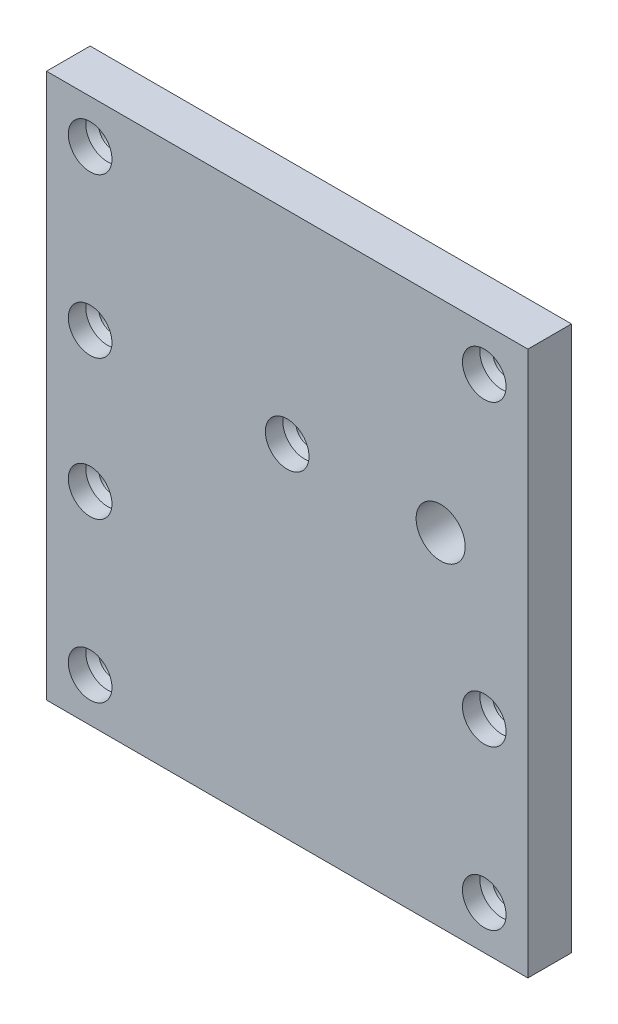
ISO-10303-21;
HEADER;
FILE_DESCRIPTION(('STEP AP214'),'2;1');
FILE_NAME('part.step','',(''),(''),'','','');
FILE_SCHEMA(('AUTOMOTIVE_DESIGN { 1 0 10303 214 1 1 1 1 }'));
ENDSEC;
DATA;
#1=APPLICATION_CONTEXT('core data for automotive mechanical design processes');
#2=APPLICATION_PROTOCOL_DEFINITION('international standard','automotive_design',2000,#1);
#3=PRODUCT_CONTEXT('',#1,'mechanical');
#4=PRODUCT('Part','Part','',(#3));
#5=PRODUCT_RELATED_PRODUCT_CATEGORY('part','',(#4));
#6=PRODUCT_DEFINITION_FORMATION('','',#4);
#7=PRODUCT_DEFINITION_CONTEXT('part definition',#1,'design');
#8=PRODUCT_DEFINITION('design','',#6,#7);
#9=PRODUCT_DEFINITION_SHAPE('','',#8);
#10=(LENGTH_UNIT() NAMED_UNIT(*) SI_UNIT(.MILLI.,.METRE.));
#11=(NAMED_UNIT(*) PLANE_ANGLE_UNIT() SI_UNIT($,.RADIAN.));
#12=(NAMED_UNIT(*) SI_UNIT($,.STERADIAN.) SOLID_ANGLE_UNIT());
#13=UNCERTAINTY_MEASURE_WITH_UNIT(LENGTH_MEASURE(1.E-05),#10,'distance_accuracy_value','');
#14=(GEOMETRIC_REPRESENTATION_CONTEXT(3) GLOBAL_UNCERTAINTY_ASSIGNED_CONTEXT((#13)) GLOBAL_UNIT_ASSIGNED_CONTEXT((#10,
#11,#12)) REPRESENTATION_CONTEXT('',''));
#15=CARTESIAN_POINT('',(0.,0.,0.));
#16=DIRECTION('',(0.,0.,1.));
#17=DIRECTION('',(1.,0.,0.));
#18=AXIS2_PLACEMENT_3D('',#15,#16,#17);
#19=CARTESIAN_POINT('',(20.3421458224966,15.5298639823762,3.175));
#20=DIRECTION('',(-1.,0.,0.));
#21=DIRECTION('',(0.,0.,1.));
#22=AXIS2_PLACEMENT_3D('',#19,#20,#21);
#23=PLANE('',#22);
#24=DIRECTION('',(0.,1.,0.));
#25=VECTOR('',#24,1.);
#26=CARTESIAN_POINT('',(20.3421458224966,15.5298639823762,0.));
#27=LINE('',#26,#25);
#28=CARTESIAN_POINT('',(20.3421458224966,15.5298639823762,0.));
#29=VERTEX_POINT('',#28);
#30=CARTESIAN_POINT('',(20.3421458224966,55.1792639823763,0.));
#31=VERTEX_POINT('',#30);
#32=EDGE_CURVE('E98',#29,#31,#27,.T.);
#33=ORIENTED_EDGE('',*,*,#32,.T.);
#34=DIRECTION('',(0.,0.,-1.));
#35=VECTOR('',#34,1.);
#36=CARTESIAN_POINT('',(20.3421458224966,55.1792639823763,3.175));
#37=LINE('',#36,#35);
#38=CARTESIAN_POINT('',(20.3421458224966,55.1792639823763,3.175));
#39=VERTEX_POINT('',#38);
#40=EDGE_CURVE('E11',#39,#31,#37,.T.);
#41=ORIENTED_EDGE('',*,*,#40,.F.);
#42=DIRECTION('',(0.,1.,0.));
#43=VECTOR('',#42,1.);
#44=CARTESIAN_POINT('',(20.3421458224966,15.5298639823762,3.175));
#45=LINE('',#44,#43);
#46=CARTESIAN_POINT('',(20.3421458224966,15.5298639823762,3.175));
#47=VERTEX_POINT('',#46);
#48=EDGE_CURVE('E85',#47,#39,#45,.T.);
#49=ORIENTED_EDGE('',*,*,#48,.F.);
#50=DIRECTION('',(0.,0.,-1.));
#51=VECTOR('',#50,1.);
#52=CARTESIAN_POINT('',(20.3421458224966,15.5298639823762,3.175));
#53=LINE('',#52,#51);
#54=EDGE_CURVE('E94',#47,#29,#53,.T.);
#55=ORIENTED_EDGE('',*,*,#54,.T.);
#56=EDGE_LOOP('',(#33,#41,#49,#55));
#57=FACE_BOUND('',#56,.T.);
#58=ADVANCED_FACE('F32',(#57),#23,.F.);
#59=CARTESIAN_POINT('',(20.3421458224966,55.1792639823763,3.175));
#60=DIRECTION('',(0.,-1.,0.));
#61=DIRECTION('',(1.,0.,0.));
#62=AXIS2_PLACEMENT_3D('',#59,#60,#61);
#63=PLANE('',#62);
#64=DIRECTION('',(-1.,0.,0.));
#65=VECTOR('',#64,1.);
#66=CARTESIAN_POINT('',(20.3421458224966,55.1792639823763,0.));
#67=LINE('',#66,#65);
#68=CARTESIAN_POINT('',(-14.7,55.1792639823762,0.));
#69=VERTEX_POINT('',#68);
#70=EDGE_CURVE('E89',#31,#69,#67,.T.);
#71=ORIENTED_EDGE('',*,*,#70,.T.);
#72=DIRECTION('',(0.,0.,-1.));
#73=VECTOR('',#72,1.);
#74=CARTESIAN_POINT('',(-14.7,55.1792639823762,3.175));
#75=LINE('',#74,#73);
#76=CARTESIAN_POINT('',(-14.7,55.1792639823762,3.175));
#77=VERTEX_POINT('',#76);
#78=EDGE_CURVE('E41',#77,#69,#75,.T.);
#79=ORIENTED_EDGE('',*,*,#78,.F.);
#80=DIRECTION('',(-1.,0.,0.));
#81=VECTOR('',#80,1.);
#82=CARTESIAN_POINT('',(20.3421458224966,55.1792639823763,3.175));
#83=LINE('',#82,#81);
#84=EDGE_CURVE('E80',#39,#77,#83,.T.);
#85=ORIENTED_EDGE('',*,*,#84,.F.);
#86=ORIENTED_EDGE('',*,*,#40,.T.);
#87=EDGE_LOOP('',(#71,#79,#85,#86));
#88=FACE_BOUND('',#87,.T.);
#89=ADVANCED_FACE('F88',(#88),#63,.F.);
#90=CARTESIAN_POINT('',(-14.7,15.5298639823762,3.175));
#91=DIRECTION('',(1.,0.,0.));
#92=DIRECTION('',(0.,0.,-1.));
#93=AXIS2_PLACEMENT_3D('',#90,#91,#92);
#94=PLANE('',#93);
#95=DIRECTION('',(0.,-1.,0.));
#96=VECTOR('',#95,1.);
#97=CARTESIAN_POINT('',(-14.7,15.5298639823762,0.));
#98=LINE('',#97,#96);
#99=CARTESIAN_POINT('',(-14.7,15.5298639823762,0.));
#100=VERTEX_POINT('',#99);
#101=EDGE_CURVE('E67',#69,#100,#98,.T.);
#102=ORIENTED_EDGE('',*,*,#101,.T.);
#103=DIRECTION('',(0.,0.,-1.));
#104=VECTOR('',#103,1.);
#105=CARTESIAN_POINT('',(-14.7,15.5298639823762,3.175));
#106=LINE('',#105,#104);
#107=CARTESIAN_POINT('',(-14.7,15.5298639823762,3.175));
#108=VERTEX_POINT('',#107);
#109=EDGE_CURVE('E90',#108,#100,#106,.T.);
#110=ORIENTED_EDGE('',*,*,#109,.F.);
#111=DIRECTION('',(0.,-1.,0.));
#112=VECTOR('',#111,1.);
#113=CARTESIAN_POINT('',(-14.7,15.5298639823762,3.175));
#114=LINE('',#113,#112);
#115=EDGE_CURVE('E83',#77,#108,#114,.T.);
#116=ORIENTED_EDGE('',*,*,#115,.F.);
#117=ORIENTED_EDGE('',*,*,#78,.T.);
#118=EDGE_LOOP('',(#102,#110,#116,#117));
#119=FACE_BOUND('',#118,.T.);
#120=ADVANCED_FACE('F92',(#119),#94,.F.);
#121=CARTESIAN_POINT('',(20.3421458224966,15.5298639823762,3.175));
#122=DIRECTION('',(0.,1.,0.));
#123=DIRECTION('',(-1.,0.,0.));
#124=AXIS2_PLACEMENT_3D('',#121,#122,#123);
#125=PLANE('',#124);
#126=DIRECTION('',(1.,0.,0.));
#127=VECTOR('',#126,1.);
#128=CARTESIAN_POINT('',(20.3421458224966,15.5298639823762,0.));
#129=LINE('',#128,#127);
#130=EDGE_CURVE('E73',#100,#29,#129,.T.);
#131=ORIENTED_EDGE('',*,*,#130,.T.);
#132=ORIENTED_EDGE('',*,*,#54,.F.);
#133=DIRECTION('',(1.,0.,0.));
#134=VECTOR('',#133,1.);
#135=CARTESIAN_POINT('',(20.3421458224966,15.5298639823762,3.175));
#136=LINE('',#135,#134);
#137=EDGE_CURVE('E50',#108,#47,#136,.T.);
#138=ORIENTED_EDGE('',*,*,#137,.F.);
#139=ORIENTED_EDGE('',*,*,#109,.T.);
#140=EDGE_LOOP('',(#131,#132,#138,#139));
#141=FACE_BOUND('',#140,.T.);
#142=ADVANCED_FACE('F215',(#141),#125,.F.);
#143=CARTESIAN_POINT('',(0.,0.,3.175));
#144=DIRECTION('',(0.,0.,1.));
#145=DIRECTION('',(1.,0.,0.));
#146=AXIS2_PLACEMENT_3D('',#143,#144,#145);
#147=PLANE('',#146);
#148=CARTESIAN_POINT('',(17.1671458224966,18.7048639823763,3.175));
#149=DIRECTION('',(0.,0.,1.));
#150=DIRECTION('',(1.,0.,0.));
#151=AXIS2_PLACEMENT_3D('',#148,#149,#150);
#152=CIRCLE('',#151,1.58749999999999);
#153=CARTESIAN_POINT('',(18.7546458224966,18.7048639823763,3.175));
#154=VERTEX_POINT('',#153);
#155=EDGE_CURVE('E505',#154,#154,#152,.T.);
#156=ORIENTED_EDGE('',*,*,#155,.F.);
#157=EDGE_LOOP('',(#156));
#158=FACE_BOUND('',#157,.T.);
#159=CARTESIAN_POINT('',(-11.5249999999999,18.7048639823763,3.175));
#160=DIRECTION('',(0.,0.,1.));
#161=DIRECTION('',(1.,0.,0.));
#162=AXIS2_PLACEMENT_3D('',#159,#160,#161);
#163=CIRCLE('',#162,1.58749999999999);
#164=CARTESIAN_POINT('',(-9.93749999999996,18.7048639823763,3.175));
#165=VERTEX_POINT('',#164);
#166=EDGE_CURVE('E145',#165,#165,#163,.T.);
#167=ORIENTED_EDGE('',*,*,#166,.F.);
#168=EDGE_LOOP('',(#167));
#169=FACE_BOUND('',#168,.T.);
#170=CARTESIAN_POINT('',(-11.525,30.2745639823762,3.175));
#171=DIRECTION('',(0.,0.,1.));
#172=DIRECTION('',(1.,0.,0.));
#173=AXIS2_PLACEMENT_3D('',#170,#171,#172);
#174=CIRCLE('',#173,1.58749999999999);
#175=CARTESIAN_POINT('',(-9.93749999999997,30.2745639823762,3.175));
#176=VERTEX_POINT('',#175);
#177=EDGE_CURVE('E138',#176,#176,#174,.T.);
#178=ORIENTED_EDGE('',*,*,#177,.F.);
#179=EDGE_LOOP('',(#178));
#180=FACE_BOUND('',#179,.T.);
#181=CARTESIAN_POINT('',(17.1671458224966,30.2745639823762,3.175));
#182=DIRECTION('',(0.,0.,1.));
#183=DIRECTION('',(1.,0.,0.));
#184=AXIS2_PLACEMENT_3D('',#181,#182,#183);
#185=CIRCLE('',#184,1.58749999999999);
#186=CARTESIAN_POINT('',(18.7546458224966,30.2745639823762,3.175));
#187=VERTEX_POINT('',#186);
#188=EDGE_CURVE('E134',#187,#187,#185,.T.);
#189=ORIENTED_EDGE('',*,*,#188,.F.);
#190=EDGE_LOOP('',(#189));
#191=FACE_BOUND('',#190,.T.);
#192=CARTESIAN_POINT('',(2.82107291124833,40.4345639823763,3.175));
#193=DIRECTION('',(0.,0.,1.));
#194=DIRECTION('',(1.,0.,0.));
#195=AXIS2_PLACEMENT_3D('',#192,#193,#194);
#196=CIRCLE('',#195,1.58749999999999);
#197=CARTESIAN_POINT('',(4.40857291124832,40.4345639823763,3.175));
#198=VERTEX_POINT('',#197);
#199=EDGE_CURVE('E130',#198,#198,#196,.T.);
#200=ORIENTED_EDGE('',*,*,#199,.F.);
#201=EDGE_LOOP('',(#200));
#202=FACE_BOUND('',#201,.T.);
#203=CARTESIAN_POINT('',(-11.525,40.4345639823763,3.175));
#204=DIRECTION('',(0.,0.,1.));
#205=DIRECTION('',(1.,0.,0.));
#206=AXIS2_PLACEMENT_3D('',#203,#204,#205);
#207=CIRCLE('',#206,1.58749999999999);
#208=CARTESIAN_POINT('',(-9.93749999999997,40.4345639823763,3.175));
#209=VERTEX_POINT('',#208);
#210=EDGE_CURVE('E125',#209,#209,#207,.T.);
#211=ORIENTED_EDGE('',*,*,#210,.F.);
#212=EDGE_LOOP('',(#211));
#213=FACE_BOUND('',#212,.T.);
#214=CARTESIAN_POINT('',(17.1671458224966,52.0042639823762,3.175));
#215=DIRECTION('',(0.,0.,1.));
#216=DIRECTION('',(1.,0.,0.));
#217=AXIS2_PLACEMENT_3D('',#214,#215,#216);
#218=CIRCLE('',#217,1.58749999999999);
#219=CARTESIAN_POINT('',(18.7546458224966,52.0042639823762,3.175));
#220=VERTEX_POINT('',#219);
#221=EDGE_CURVE('E120',#220,#220,#218,.T.);
#222=ORIENTED_EDGE('',*,*,#221,.F.);
#223=EDGE_LOOP('',(#222));
#224=FACE_BOUND('',#223,.T.);
#225=CARTESIAN_POINT('',(-11.525,52.0042639823762,3.175));
#226=DIRECTION('',(0.,0.,1.));
#227=DIRECTION('',(1.,0.,0.));
#228=AXIS2_PLACEMENT_3D('',#225,#226,#227);
#229=CIRCLE('',#228,1.58749999999999);
#230=CARTESIAN_POINT('',(-9.93749999999997,52.0042639823762,3.175));
#231=VERTEX_POINT('',#230);
#232=EDGE_CURVE('E115',#231,#231,#229,.T.);
#233=ORIENTED_EDGE('',*,*,#232,.F.);
#234=EDGE_LOOP('',(#233));
#235=FACE_BOUND('',#234,.T.);
#236=CARTESIAN_POINT('',(13.9921458224967,40.4345639823762,3.175));
#237=DIRECTION('',(0.,0.,1.));
#238=DIRECTION('',(1.,0.,0.));
#239=AXIS2_PLACEMENT_3D('',#236,#237,#238);
#240=CIRCLE('',#239,1.786001);
#241=CARTESIAN_POINT('',(15.7781468224967,40.4345639823762,3.175));
#242=VERTEX_POINT('',#241);
#243=EDGE_CURVE('E198',#242,#242,#240,.T.);
#244=ORIENTED_EDGE('',*,*,#243,.F.);
#245=EDGE_LOOP('',(#244));
#246=FACE_BOUND('',#245,.T.);
#247=ORIENTED_EDGE('',*,*,#48,.T.);
#248=ORIENTED_EDGE('',*,*,#84,.T.);
#249=ORIENTED_EDGE('',*,*,#115,.T.);
#250=ORIENTED_EDGE('',*,*,#137,.T.);
#251=EDGE_LOOP('',(#247,#248,#249,#250));
#252=FACE_BOUND('',#251,.T.);
#253=ADVANCED_FACE('F81',(#158,#169,#180,#191,#202,#213,#224,#235,#246,#252),#147,.T.);
#254=CARTESIAN_POINT('',(0.,0.,0.));
#255=DIRECTION('',(0.,0.,1.));
#256=DIRECTION('',(1.,0.,0.));
#257=AXIS2_PLACEMENT_3D('',#254,#255,#256);
#258=PLANE('',#257);
#259=CARTESIAN_POINT('',(-11.525,40.4345639823763,0.));
#260=DIRECTION('',(0.,0.,1.));
#261=DIRECTION('',(1.,0.,0.));
#262=AXIS2_PLACEMENT_3D('',#259,#260,#261);
#263=CIRCLE('',#262,0.992251);
#264=CARTESIAN_POINT('',(-10.532749,40.4345639823763,0.));
#265=VERTEX_POINT('',#264);
#266=EDGE_CURVE('E110',#265,#265,#263,.T.);
#267=ORIENTED_EDGE('',*,*,#266,.T.);
#268=EDGE_LOOP('',(#267));
#269=FACE_BOUND('',#268,.T.);
#270=CARTESIAN_POINT('',(-11.525,52.0042639823762,0.));
#271=DIRECTION('',(0.,0.,1.));
#272=DIRECTION('',(1.,0.,0.));
#273=AXIS2_PLACEMENT_3D('',#270,#271,#272);
#274=CIRCLE('',#273,0.992251);
#275=CARTESIAN_POINT('',(-10.532749,52.0042639823762,0.));
#276=VERTEX_POINT('',#275);
#277=EDGE_CURVE('E177',#276,#276,#274,.T.);
#278=ORIENTED_EDGE('',*,*,#277,.T.);
#279=EDGE_LOOP('',(#278));
#280=FACE_BOUND('',#279,.T.);
#281=CARTESIAN_POINT('',(17.1671458224966,52.0042639823762,0.));
#282=DIRECTION('',(0.,0.,1.));
#283=DIRECTION('',(1.,0.,0.));
#284=AXIS2_PLACEMENT_3D('',#281,#282,#283);
#285=CIRCLE('',#284,0.992251);
#286=CARTESIAN_POINT('',(18.1593968224966,52.0042639823762,0.));
#287=VERTEX_POINT('',#286);
#288=EDGE_CURVE('E180',#287,#287,#285,.T.);
#289=ORIENTED_EDGE('',*,*,#288,.T.);
#290=EDGE_LOOP('',(#289));
#291=FACE_BOUND('',#290,.T.);
#292=CARTESIAN_POINT('',(2.82107291124833,40.4345639823763,0.));
#293=DIRECTION('',(0.,0.,1.));
#294=DIRECTION('',(1.,0.,0.));
#295=AXIS2_PLACEMENT_3D('',#292,#293,#294);
#296=CIRCLE('',#295,0.992250999999999);
#297=CARTESIAN_POINT('',(3.81332391124833,40.4345639823763,0.));
#298=VERTEX_POINT('',#297);
#299=EDGE_CURVE('E183',#298,#298,#296,.T.);
#300=ORIENTED_EDGE('',*,*,#299,.T.);
#301=EDGE_LOOP('',(#300));
#302=FACE_BOUND('',#301,.T.);
#303=CARTESIAN_POINT('',(-11.525,30.2745639823762,0.));
#304=DIRECTION('',(0.,0.,1.));
#305=DIRECTION('',(1.,0.,0.));
#306=AXIS2_PLACEMENT_3D('',#303,#304,#305);
#307=CIRCLE('',#306,0.992251);
#308=CARTESIAN_POINT('',(-10.532749,30.2745639823762,0.));
#309=VERTEX_POINT('',#308);
#310=EDGE_CURVE('E186',#309,#309,#307,.T.);
#311=ORIENTED_EDGE('',*,*,#310,.T.);
#312=EDGE_LOOP('',(#311));
#313=FACE_BOUND('',#312,.T.);
#314=CARTESIAN_POINT('',(-11.5249999999999,18.7048639823763,0.));
#315=DIRECTION('',(0.,0.,1.));
#316=DIRECTION('',(1.,0.,0.));
#317=AXIS2_PLACEMENT_3D('',#314,#315,#316);
#318=CIRCLE('',#317,0.992251);
#319=CARTESIAN_POINT('',(-10.5327489999999,18.7048639823763,0.));
#320=VERTEX_POINT('',#319);
#321=EDGE_CURVE('E189',#320,#320,#318,.T.);
#322=ORIENTED_EDGE('',*,*,#321,.T.);
#323=EDGE_LOOP('',(#322));
#324=FACE_BOUND('',#323,.T.);
#325=CARTESIAN_POINT('',(17.1671458224966,18.7048639823763,0.));
#326=DIRECTION('',(0.,0.,1.));
#327=DIRECTION('',(1.,0.,0.));
#328=AXIS2_PLACEMENT_3D('',#325,#326,#327);
#329=CIRCLE('',#328,0.992251);
#330=CARTESIAN_POINT('',(18.1593968224966,18.7048639823763,0.));
#331=VERTEX_POINT('',#330);
#332=EDGE_CURVE('E192',#331,#331,#329,.T.);
#333=ORIENTED_EDGE('',*,*,#332,.T.);
#334=EDGE_LOOP('',(#333));
#335=FACE_BOUND('',#334,.T.);
#336=CARTESIAN_POINT('',(17.1671458224966,30.2745639823762,0.));
#337=DIRECTION('',(0.,0.,1.));
#338=DIRECTION('',(1.,0.,0.));
#339=AXIS2_PLACEMENT_3D('',#336,#337,#338);
#340=CIRCLE('',#339,0.992251);
#341=CARTESIAN_POINT('',(18.1593968224966,30.2745639823762,0.));
#342=VERTEX_POINT('',#341);
#343=EDGE_CURVE('E195',#342,#342,#340,.T.);
#344=ORIENTED_EDGE('',*,*,#343,.T.);
#345=EDGE_LOOP('',(#344));
#346=FACE_BOUND('',#345,.T.);
#347=CARTESIAN_POINT('',(13.9921458224967,40.4345639823762,0.));
#348=DIRECTION('',(0.,0.,1.));
#349=DIRECTION('',(1.,0.,0.));
#350=AXIS2_PLACEMENT_3D('',#347,#348,#349);
#351=CIRCLE('',#350,1.786001);
#352=CARTESIAN_POINT('',(15.7781468224967,40.4345639823762,0.));
#353=VERTEX_POINT('',#352);
#354=EDGE_CURVE('E101',#353,#353,#351,.T.);
#355=ORIENTED_EDGE('',*,*,#354,.T.);
#356=EDGE_LOOP('',(#355));
#357=FACE_BOUND('',#356,.T.);
#358=ORIENTED_EDGE('',*,*,#32,.F.);
#359=ORIENTED_EDGE('',*,*,#130,.F.);
#360=ORIENTED_EDGE('',*,*,#101,.F.);
#361=ORIENTED_EDGE('',*,*,#70,.F.);
#362=EDGE_LOOP('',(#358,#359,#360,#361));
#363=FACE_BOUND('',#362,.T.);
#364=ADVANCED_FACE('F204',(#269,#280,#291,#302,#313,#324,#335,#346,#357,#363),#258,.F.);
#365=CARTESIAN_POINT('',(13.9921458224967,40.4345639823762,3.175));
#366=DIRECTION('',(0.,0.,1.));
#367=DIRECTION('',(1.,0.,0.));
#368=AXIS2_PLACEMENT_3D('',#365,#366,#367);
#369=CYLINDRICAL_SURFACE('',#368,1.786001);
#370=ORIENTED_EDGE('',*,*,#354,.F.);
#371=EDGE_LOOP('',(#370));
#372=FACE_BOUND('',#371,.T.);
#373=ORIENTED_EDGE('',*,*,#243,.T.);
#374=EDGE_LOOP('',(#373));
#375=FACE_BOUND('',#374,.T.);
#376=ADVANCED_FACE('F207',(#372,#375),#369,.F.);
#377=CARTESIAN_POINT('',(17.1671458224966,30.2745639823762,3.175));
#378=DIRECTION('',(0.,0.,1.));
#379=DIRECTION('',(1.,0.,0.));
#380=AXIS2_PLACEMENT_3D('',#377,#378,#379);
#381=CYLINDRICAL_SURFACE('',#380,0.992251);
#382=CARTESIAN_POINT('',(17.1671458224966,30.2745639823762,1.54733831738446));
#383=DIRECTION('',(0.,0.,1.));
#384=DIRECTION('',(1.,0.,0.));
#385=AXIS2_PLACEMENT_3D('',#382,#383,#384);
#386=CIRCLE('',#385,0.992251);
#387=CARTESIAN_POINT('',(18.1593968224966,30.2745639823762,1.54733831738446));
#388=VERTEX_POINT('',#387);
#389=EDGE_CURVE('E127',#388,#388,#386,.T.);
#390=ORIENTED_EDGE('',*,*,#389,.T.);
#391=EDGE_LOOP('',(#390));
#392=FACE_BOUND('',#391,.T.);
#393=ORIENTED_EDGE('',*,*,#343,.F.);
#394=EDGE_LOOP('',(#393));
#395=FACE_BOUND('',#394,.T.);
#396=ADVANCED_FACE('F210',(#392,#395),#381,.F.);
#397=CARTESIAN_POINT('',(17.1671458224966,18.7048639823763,3.175));
#398=DIRECTION('',(0.,0.,1.));
#399=DIRECTION('',(1.,0.,0.));
#400=AXIS2_PLACEMENT_3D('',#397,#398,#399);
#401=CYLINDRICAL_SURFACE('',#400,0.992251);
#402=CARTESIAN_POINT('',(17.1671458224966,18.7048639823763,1.54733831738446));
#403=DIRECTION('',(0.,0.,1.));
#404=DIRECTION('',(1.,0.,0.));
#405=AXIS2_PLACEMENT_3D('',#402,#403,#404);
#406=CIRCLE('',#405,0.992251);
#407=CARTESIAN_POINT('',(18.1593968224966,18.7048639823763,1.54733831738446));
#408=VERTEX_POINT('',#407);
#409=EDGE_CURVE('E35',#408,#408,#406,.T.);
#410=ORIENTED_EDGE('',*,*,#409,.T.);
#411=EDGE_LOOP('',(#410));
#412=FACE_BOUND('',#411,.T.);
#413=ORIENTED_EDGE('',*,*,#332,.F.);
#414=EDGE_LOOP('',(#413));
#415=FACE_BOUND('',#414,.T.);
#416=ADVANCED_FACE('F268',(#412,#415),#401,.F.);
#417=CARTESIAN_POINT('',(-11.5249999999999,18.7048639823763,3.175));
#418=DIRECTION('',(0.,0.,1.));
#419=DIRECTION('',(1.,0.,0.));
#420=AXIS2_PLACEMENT_3D('',#417,#418,#419);
#421=CYLINDRICAL_SURFACE('',#420,0.992251);
#422=CARTESIAN_POINT('',(-11.5249999999999,18.7048639823763,1.54733831738446));
#423=DIRECTION('',(0.,0.,1.));
#424=DIRECTION('',(1.,0.,0.));
#425=AXIS2_PLACEMENT_3D('',#422,#423,#424);
#426=CIRCLE('',#425,0.992251);
#427=CARTESIAN_POINT('',(-10.5327489999999,18.7048639823763,1.54733831738446));
#428=VERTEX_POINT('',#427);
#429=EDGE_CURVE('E136',#428,#428,#426,.T.);
#430=ORIENTED_EDGE('',*,*,#429,.T.);
#431=EDGE_LOOP('',(#430));
#432=FACE_BOUND('',#431,.T.);
#433=ORIENTED_EDGE('',*,*,#321,.F.);
#434=EDGE_LOOP('',(#433));
#435=FACE_BOUND('',#434,.T.);
#436=ADVANCED_FACE('F278',(#432,#435),#421,.F.);
#437=CARTESIAN_POINT('',(-11.525,30.2745639823762,3.175));
#438=DIRECTION('',(0.,0.,1.));
#439=DIRECTION('',(1.,0.,0.));
#440=AXIS2_PLACEMENT_3D('',#437,#438,#439);
#441=CYLINDRICAL_SURFACE('',#440,0.992251);
#442=CARTESIAN_POINT('',(-11.525,30.2745639823762,1.54733831738446));
#443=DIRECTION('',(0.,0.,1.));
#444=DIRECTION('',(1.,0.,0.));
#445=AXIS2_PLACEMENT_3D('',#442,#443,#444);
#446=CIRCLE('',#445,0.992251);
#447=CARTESIAN_POINT('',(-10.532749,30.2745639823762,1.54733831738446));
#448=VERTEX_POINT('',#447);
#449=EDGE_CURVE('E132',#448,#448,#446,.T.);
#450=ORIENTED_EDGE('',*,*,#449,.T.);
#451=EDGE_LOOP('',(#450));
#452=FACE_BOUND('',#451,.T.);
#453=ORIENTED_EDGE('',*,*,#310,.F.);
#454=EDGE_LOOP('',(#453));
#455=FACE_BOUND('',#454,.T.);
#456=ADVANCED_FACE('F288',(#452,#455),#441,.F.);
#457=CARTESIAN_POINT('',(2.82107291124833,40.4345639823763,3.175));
#458=DIRECTION('',(0.,0.,1.));
#459=DIRECTION('',(1.,0.,0.));
#460=AXIS2_PLACEMENT_3D('',#457,#458,#459);
#461=CYLINDRICAL_SURFACE('',#460,0.992250999999999);
#462=CARTESIAN_POINT('',(2.82107291124833,40.4345639823763,1.54733831738446));
#463=DIRECTION('',(0.,0.,1.));
#464=DIRECTION('',(1.,0.,0.));
#465=AXIS2_PLACEMENT_3D('',#462,#463,#464);
#466=CIRCLE('',#465,0.992250999999999);
#467=CARTESIAN_POINT('',(3.81332391124833,40.4345639823763,1.54733831738446));
#468=VERTEX_POINT('',#467);
#469=EDGE_CURVE('E122',#468,#468,#466,.T.);
#470=ORIENTED_EDGE('',*,*,#469,.T.);
#471=EDGE_LOOP('',(#470));
#472=FACE_BOUND('',#471,.T.);
#473=ORIENTED_EDGE('',*,*,#299,.F.);
#474=EDGE_LOOP('',(#473));
#475=FACE_BOUND('',#474,.T.);
#476=ADVANCED_FACE('F297',(#472,#475),#461,.F.);
#477=CARTESIAN_POINT('',(17.1671458224966,52.0042639823762,3.175));
#478=DIRECTION('',(0.,0.,1.));
#479=DIRECTION('',(1.,0.,0.));
#480=AXIS2_PLACEMENT_3D('',#477,#478,#479);
#481=CYLINDRICAL_SURFACE('',#480,0.992251);
#482=CARTESIAN_POINT('',(17.1671458224966,52.0042639823762,1.54733831738446));
#483=DIRECTION('',(0.,0.,1.));
#484=DIRECTION('',(1.,0.,0.));
#485=AXIS2_PLACEMENT_3D('',#482,#483,#484);
#486=CIRCLE('',#485,0.992251);
#487=CARTESIAN_POINT('',(18.1593968224966,52.0042639823762,1.54733831738446));
#488=VERTEX_POINT('',#487);
#489=EDGE_CURVE('E112',#488,#488,#486,.T.);
#490=ORIENTED_EDGE('',*,*,#489,.T.);
#491=EDGE_LOOP('',(#490));
#492=FACE_BOUND('',#491,.T.);
#493=ORIENTED_EDGE('',*,*,#288,.F.);
#494=EDGE_LOOP('',(#493));
#495=FACE_BOUND('',#494,.T.);
#496=ADVANCED_FACE('F307',(#492,#495),#481,.F.);
#497=CARTESIAN_POINT('',(-11.525,52.0042639823762,3.175));
#498=DIRECTION('',(0.,0.,1.));
#499=DIRECTION('',(1.,0.,0.));
#500=AXIS2_PLACEMENT_3D('',#497,#498,#499);
#501=CYLINDRICAL_SURFACE('',#500,0.992251);
#502=CARTESIAN_POINT('',(-11.525,52.0042639823762,1.54733831738446));
#503=DIRECTION('',(0.,0.,1.));
#504=DIRECTION('',(1.,0.,0.));
#505=AXIS2_PLACEMENT_3D('',#502,#503,#504);
#506=CIRCLE('',#505,0.992251);
#507=CARTESIAN_POINT('',(-10.532749,52.0042639823762,1.54733831738446));
#508=VERTEX_POINT('',#507);
#509=EDGE_CURVE('E107',#508,#508,#506,.T.);
#510=ORIENTED_EDGE('',*,*,#509,.T.);
#511=EDGE_LOOP('',(#510));
#512=FACE_BOUND('',#511,.T.);
#513=ORIENTED_EDGE('',*,*,#277,.F.);
#514=EDGE_LOOP('',(#513));
#515=FACE_BOUND('',#514,.T.);
#516=ADVANCED_FACE('F317',(#512,#515),#501,.F.);
#517=CARTESIAN_POINT('',(-11.525,40.4345639823763,3.175));
#518=DIRECTION('',(0.,0.,1.));
#519=DIRECTION('',(1.,0.,0.));
#520=AXIS2_PLACEMENT_3D('',#517,#518,#519);
#521=CYLINDRICAL_SURFACE('',#520,0.992251);
#522=CARTESIAN_POINT('',(-11.525,40.4345639823763,1.54733831738446));
#523=DIRECTION('',(0.,0.,1.));
#524=DIRECTION('',(1.,0.,0.));
#525=AXIS2_PLACEMENT_3D('',#522,#523,#524);
#526=CIRCLE('',#525,0.992251);
#527=CARTESIAN_POINT('',(-10.532749,40.4345639823763,1.54733831738446));
#528=VERTEX_POINT('',#527);
#529=EDGE_CURVE('E117',#528,#528,#526,.T.);
#530=ORIENTED_EDGE('',*,*,#529,.T.);
#531=EDGE_LOOP('',(#530));
#532=FACE_BOUND('',#531,.T.);
#533=ORIENTED_EDGE('',*,*,#266,.F.);
#534=EDGE_LOOP('',(#533));
#535=FACE_BOUND('',#534,.T.);
#536=ADVANCED_FACE('F327',(#532,#535),#521,.F.);
#537=CARTESIAN_POINT('',(-11.525,52.0042639823762,1.905));
#538=DIRECTION('',(0.,0.,1.));
#539=DIRECTION('',(1.,0.,0.));
#540=AXIS2_PLACEMENT_3D('',#537,#538,#539);
#541=CONICAL_SURFACE('',#540,1.5875,1.02974425867665);
#542=CARTESIAN_POINT('',(-11.525,52.0042639823762,1.905));
#543=DIRECTION('',(0.,0.,1.));
#544=DIRECTION('',(1.,0.,0.));
#545=AXIS2_PLACEMENT_3D('',#542,#543,#544);
#546=CIRCLE('',#545,1.5875);
#547=CARTESIAN_POINT('',(-9.93749999999996,52.0042639823762,1.905));
#548=VERTEX_POINT('',#547);
#549=EDGE_CURVE('E111',#548,#548,#546,.T.);
#550=ORIENTED_EDGE('',*,*,#549,.T.);
#551=EDGE_LOOP('',(#550));
#552=FACE_BOUND('',#551,.T.);
#553=ORIENTED_EDGE('',*,*,#509,.F.);
#554=EDGE_LOOP('',(#553));
#555=FACE_BOUND('',#554,.T.);
#556=ADVANCED_FACE('F337',(#552,#555),#541,.F.);
#557=CARTESIAN_POINT('',(-11.525,52.0042639823762,3.175));
#558=DIRECTION('',(0.,0.,1.));
#559=DIRECTION('',(1.,0.,0.));
#560=AXIS2_PLACEMENT_3D('',#557,#558,#559);
#561=CYLINDRICAL_SURFACE('',#560,1.58749999999999);
#562=ORIENTED_EDGE('',*,*,#549,.F.);
#563=EDGE_LOOP('',(#562));
#564=FACE_BOUND('',#563,.T.);
#565=ORIENTED_EDGE('',*,*,#232,.T.);
#566=EDGE_LOOP('',(#565));
#567=FACE_BOUND('',#566,.T.);
#568=ADVANCED_FACE('F347',(#564,#567),#561,.F.);
#569=CARTESIAN_POINT('',(17.1671458224966,52.0042639823762,1.905));
#570=DIRECTION('',(0.,0.,1.));
#571=DIRECTION('',(1.,0.,0.));
#572=AXIS2_PLACEMENT_3D('',#569,#570,#571);
#573=CONICAL_SURFACE('',#572,1.5875,1.02974425867665);
#574=CARTESIAN_POINT('',(17.1671458224966,52.0042639823762,1.905));
#575=DIRECTION('',(0.,0.,1.));
#576=DIRECTION('',(1.,0.,0.));
#577=AXIS2_PLACEMENT_3D('',#574,#575,#576);
#578=CIRCLE('',#577,1.5875);
#579=CARTESIAN_POINT('',(18.7546458224966,52.0042639823762,1.905));
#580=VERTEX_POINT('',#579);
#581=EDGE_CURVE('E116',#580,#580,#578,.T.);
#582=ORIENTED_EDGE('',*,*,#581,.T.);
#583=EDGE_LOOP('',(#582));
#584=FACE_BOUND('',#583,.T.);
#585=ORIENTED_EDGE('',*,*,#489,.F.);
#586=EDGE_LOOP('',(#585));
#587=FACE_BOUND('',#586,.T.);
#588=ADVANCED_FACE('F357',(#584,#587),#573,.F.);
#589=CARTESIAN_POINT('',(17.1671458224966,52.0042639823762,3.175));
#590=DIRECTION('',(0.,0.,1.));
#591=DIRECTION('',(1.,0.,0.));
#592=AXIS2_PLACEMENT_3D('',#589,#590,#591);
#593=CYLINDRICAL_SURFACE('',#592,1.58749999999999);
#594=ORIENTED_EDGE('',*,*,#581,.F.);
#595=EDGE_LOOP('',(#594));
#596=FACE_BOUND('',#595,.T.);
#597=ORIENTED_EDGE('',*,*,#221,.T.);
#598=EDGE_LOOP('',(#597));
#599=FACE_BOUND('',#598,.T.);
#600=ADVANCED_FACE('F367',(#596,#599),#593,.F.);
#601=CARTESIAN_POINT('',(-11.525,40.4345639823763,1.905));
#602=DIRECTION('',(0.,0.,1.));
#603=DIRECTION('',(1.,0.,0.));
#604=AXIS2_PLACEMENT_3D('',#601,#602,#603);
#605=CONICAL_SURFACE('',#604,1.5875,1.02974425867665);
#606=CARTESIAN_POINT('',(-11.525,40.4345639823763,1.905));
#607=DIRECTION('',(0.,0.,1.));
#608=DIRECTION('',(1.,0.,0.));
#609=AXIS2_PLACEMENT_3D('',#606,#607,#608);
#610=CIRCLE('',#609,1.5875);
#611=CARTESIAN_POINT('',(-9.93749999999996,40.4345639823763,1.905));
#612=VERTEX_POINT('',#611);
#613=EDGE_CURVE('E121',#612,#612,#610,.T.);
#614=ORIENTED_EDGE('',*,*,#613,.T.);
#615=EDGE_LOOP('',(#614));
#616=FACE_BOUND('',#615,.T.);
#617=ORIENTED_EDGE('',*,*,#529,.F.);
#618=EDGE_LOOP('',(#617));
#619=FACE_BOUND('',#618,.T.);
#620=ADVANCED_FACE('F377',(#616,#619),#605,.F.);
#621=CARTESIAN_POINT('',(-11.525,40.4345639823763,3.175));
#622=DIRECTION('',(0.,0.,1.));
#623=DIRECTION('',(1.,0.,0.));
#624=AXIS2_PLACEMENT_3D('',#621,#622,#623);
#625=CYLINDRICAL_SURFACE('',#624,1.58749999999999);
#626=ORIENTED_EDGE('',*,*,#613,.F.);
#627=EDGE_LOOP('',(#626));
#628=FACE_BOUND('',#627,.T.);
#629=ORIENTED_EDGE('',*,*,#210,.T.);
#630=EDGE_LOOP('',(#629));
#631=FACE_BOUND('',#630,.T.);
#632=ADVANCED_FACE('F387',(#628,#631),#625,.F.);
#633=CARTESIAN_POINT('',(2.82107291124833,40.4345639823763,1.905));
#634=DIRECTION('',(0.,0.,1.));
#635=DIRECTION('',(1.,0.,0.));
#636=AXIS2_PLACEMENT_3D('',#633,#634,#635);
#637=CONICAL_SURFACE('',#636,1.5875,1.02974425867665);
#638=CARTESIAN_POINT('',(2.82107291124833,40.4345639823763,1.905));
#639=DIRECTION('',(0.,0.,1.));
#640=DIRECTION('',(1.,0.,0.));
#641=AXIS2_PLACEMENT_3D('',#638,#639,#640);
#642=CIRCLE('',#641,1.5875);
#643=CARTESIAN_POINT('',(4.40857291124833,40.4345639823763,1.905));
#644=VERTEX_POINT('',#643);
#645=EDGE_CURVE('E126',#644,#644,#642,.T.);
#646=ORIENTED_EDGE('',*,*,#645,.T.);
#647=EDGE_LOOP('',(#646));
#648=FACE_BOUND('',#647,.T.);
#649=ORIENTED_EDGE('',*,*,#469,.F.);
#650=EDGE_LOOP('',(#649));
#651=FACE_BOUND('',#650,.T.);
#652=ADVANCED_FACE('F397',(#648,#651),#637,.F.);
#653=CARTESIAN_POINT('',(2.82107291124833,40.4345639823763,3.175));
#654=DIRECTION('',(0.,0.,1.));
#655=DIRECTION('',(1.,0.,0.));
#656=AXIS2_PLACEMENT_3D('',#653,#654,#655);
#657=CYLINDRICAL_SURFACE('',#656,1.58749999999999);
#658=ORIENTED_EDGE('',*,*,#645,.F.);
#659=EDGE_LOOP('',(#658));
#660=FACE_BOUND('',#659,.T.);
#661=ORIENTED_EDGE('',*,*,#199,.T.);
#662=EDGE_LOOP('',(#661));
#663=FACE_BOUND('',#662,.T.);
#664=ADVANCED_FACE('F407',(#660,#663),#657,.F.);
#665=CARTESIAN_POINT('',(17.1671458224966,30.2745639823762,1.905));
#666=DIRECTION('',(0.,0.,1.));
#667=DIRECTION('',(1.,0.,0.));
#668=AXIS2_PLACEMENT_3D('',#665,#666,#667);
#669=CONICAL_SURFACE('',#668,1.5875,1.02974425867665);
#670=CARTESIAN_POINT('',(17.1671458224966,30.2745639823762,1.905));
#671=DIRECTION('',(0.,0.,1.));
#672=DIRECTION('',(1.,0.,0.));
#673=AXIS2_PLACEMENT_3D('',#670,#671,#672);
#674=CIRCLE('',#673,1.5875);
#675=CARTESIAN_POINT('',(18.7546458224966,30.2745639823762,1.905));
#676=VERTEX_POINT('',#675);
#677=EDGE_CURVE('E131',#676,#676,#674,.T.);
#678=ORIENTED_EDGE('',*,*,#677,.T.);
#679=EDGE_LOOP('',(#678));
#680=FACE_BOUND('',#679,.T.);
#681=ORIENTED_EDGE('',*,*,#389,.F.);
#682=EDGE_LOOP('',(#681));
#683=FACE_BOUND('',#682,.T.);
#684=ADVANCED_FACE('F417',(#680,#683),#669,.F.);
#685=CARTESIAN_POINT('',(17.1671458224966,30.2745639823762,3.175));
#686=DIRECTION('',(0.,0.,1.));
#687=DIRECTION('',(1.,0.,0.));
#688=AXIS2_PLACEMENT_3D('',#685,#686,#687);
#689=CYLINDRICAL_SURFACE('',#688,1.58749999999999);
#690=ORIENTED_EDGE('',*,*,#677,.F.);
#691=EDGE_LOOP('',(#690));
#692=FACE_BOUND('',#691,.T.);
#693=ORIENTED_EDGE('',*,*,#188,.T.);
#694=EDGE_LOOP('',(#693));
#695=FACE_BOUND('',#694,.T.);
#696=ADVANCED_FACE('F427',(#692,#695),#689,.F.);
#697=CARTESIAN_POINT('',(-11.525,30.2745639823762,1.905));
#698=DIRECTION('',(0.,0.,1.));
#699=DIRECTION('',(1.,0.,0.));
#700=AXIS2_PLACEMENT_3D('',#697,#698,#699);
#701=CONICAL_SURFACE('',#700,1.5875,1.02974425867665);
#702=CARTESIAN_POINT('',(-11.525,30.2745639823762,1.905));
#703=DIRECTION('',(0.,0.,1.));
#704=DIRECTION('',(1.,0.,0.));
#705=AXIS2_PLACEMENT_3D('',#702,#703,#704);
#706=CIRCLE('',#705,1.5875);
#707=CARTESIAN_POINT('',(-9.93749999999996,30.2745639823762,1.905));
#708=VERTEX_POINT('',#707);
#709=EDGE_CURVE('E135',#708,#708,#706,.T.);
#710=ORIENTED_EDGE('',*,*,#709,.T.);
#711=EDGE_LOOP('',(#710));
#712=FACE_BOUND('',#711,.T.);
#713=ORIENTED_EDGE('',*,*,#449,.F.);
#714=EDGE_LOOP('',(#713));
#715=FACE_BOUND('',#714,.T.);
#716=ADVANCED_FACE('F437',(#712,#715),#701,.F.);
#717=CARTESIAN_POINT('',(-11.525,30.2745639823762,3.175));
#718=DIRECTION('',(0.,0.,1.));
#719=DIRECTION('',(1.,0.,0.));
#720=AXIS2_PLACEMENT_3D('',#717,#718,#719);
#721=CYLINDRICAL_SURFACE('',#720,1.58749999999999);
#722=ORIENTED_EDGE('',*,*,#709,.F.);
#723=EDGE_LOOP('',(#722));
#724=FACE_BOUND('',#723,.T.);
#725=ORIENTED_EDGE('',*,*,#177,.T.);
#726=EDGE_LOOP('',(#725));
#727=FACE_BOUND('',#726,.T.);
#728=ADVANCED_FACE('F447',(#724,#727),#721,.F.);
#729=CARTESIAN_POINT('',(-11.5249999999999,18.7048639823763,1.905));
#730=DIRECTION('',(0.,0.,1.));
#731=DIRECTION('',(1.,0.,0.));
#732=AXIS2_PLACEMENT_3D('',#729,#730,#731);
#733=CONICAL_SURFACE('',#732,1.5875,1.02974425867665);
#734=CARTESIAN_POINT('',(-11.5249999999999,18.7048639823763,1.905));
#735=DIRECTION('',(0.,0.,1.));
#736=DIRECTION('',(1.,0.,0.));
#737=AXIS2_PLACEMENT_3D('',#734,#735,#736);
#738=CIRCLE('',#737,1.5875);
#739=CARTESIAN_POINT('',(-9.93749999999995,18.7048639823763,1.905));
#740=VERTEX_POINT('',#739);
#741=EDGE_CURVE('E139',#740,#740,#738,.T.);
#742=ORIENTED_EDGE('',*,*,#741,.T.);
#743=EDGE_LOOP('',(#742));
#744=FACE_BOUND('',#743,.T.);
#745=ORIENTED_EDGE('',*,*,#429,.F.);
#746=EDGE_LOOP('',(#745));
#747=FACE_BOUND('',#746,.T.);
#748=ADVANCED_FACE('F457',(#744,#747),#733,.F.);
#749=CARTESIAN_POINT('',(-11.5249999999999,18.7048639823763,3.175));
#750=DIRECTION('',(0.,0.,1.));
#751=DIRECTION('',(1.,0.,0.));
#752=AXIS2_PLACEMENT_3D('',#749,#750,#751);
#753=CYLINDRICAL_SURFACE('',#752,1.58749999999999);
#754=ORIENTED_EDGE('',*,*,#741,.F.);
#755=EDGE_LOOP('',(#754));
#756=FACE_BOUND('',#755,.T.);
#757=ORIENTED_EDGE('',*,*,#166,.T.);
#758=EDGE_LOOP('',(#757));
#759=FACE_BOUND('',#758,.T.);
#760=ADVANCED_FACE('F467',(#756,#759),#753,.F.);
#761=CARTESIAN_POINT('',(17.1671458224966,18.7048639823763,1.905));
#762=DIRECTION('',(0.,0.,1.));
#763=DIRECTION('',(1.,0.,0.));
#764=AXIS2_PLACEMENT_3D('',#761,#762,#763);
#765=CONICAL_SURFACE('',#764,1.5875,1.02974425867665);
#766=CARTESIAN_POINT('',(17.1671458224966,18.7048639823763,1.905));
#767=DIRECTION('',(0.,0.,1.));
#768=DIRECTION('',(1.,0.,0.));
#769=AXIS2_PLACEMENT_3D('',#766,#767,#768);
#770=CIRCLE('',#769,1.5875);
#771=CARTESIAN_POINT('',(18.7546458224966,18.7048639823763,1.905));
#772=VERTEX_POINT('',#771);
#773=EDGE_CURVE('E503',#772,#772,#770,.T.);
#774=ORIENTED_EDGE('',*,*,#773,.T.);
#775=EDGE_LOOP('',(#774));
#776=FACE_BOUND('',#775,.T.);
#777=ORIENTED_EDGE('',*,*,#409,.F.);
#778=EDGE_LOOP('',(#777));
#779=FACE_BOUND('',#778,.T.);
#780=ADVANCED_FACE('F476',(#776,#779),#765,.F.);
#781=CARTESIAN_POINT('',(17.1671458224966,18.7048639823763,3.175));
#782=DIRECTION('',(0.,0.,1.));
#783=DIRECTION('',(1.,0.,0.));
#784=AXIS2_PLACEMENT_3D('',#781,#782,#783);
#785=CYLINDRICAL_SURFACE('',#784,1.58749999999999);
#786=ORIENTED_EDGE('',*,*,#773,.F.);
#787=EDGE_LOOP('',(#786));
#788=FACE_BOUND('',#787,.T.);
#789=ORIENTED_EDGE('',*,*,#155,.T.);
#790=EDGE_LOOP('',(#789));
#791=FACE_BOUND('',#790,.T.);
#792=ADVANCED_FACE('F486',(#788,#791),#785,.F.);
#793=CLOSED_SHELL('',(#58,#89,#120,#142,#253,#364,#376,#396,#416,#436,#456,#476,#496,#516,#536,
#556,#568,#588,#600,#620,#632,#652,#664,#684,#696,#716,#728,#748,#760,#780,#792));
#794=MANIFOLD_SOLID_BREP('B2',#793);
#795=ADVANCED_BREP_SHAPE_REPRESENTATION('',(#18,#794),#14);
#796=SHAPE_DEFINITION_REPRESENTATION(#9,#795);
ENDSEC;
END-ISO-10303-21;
